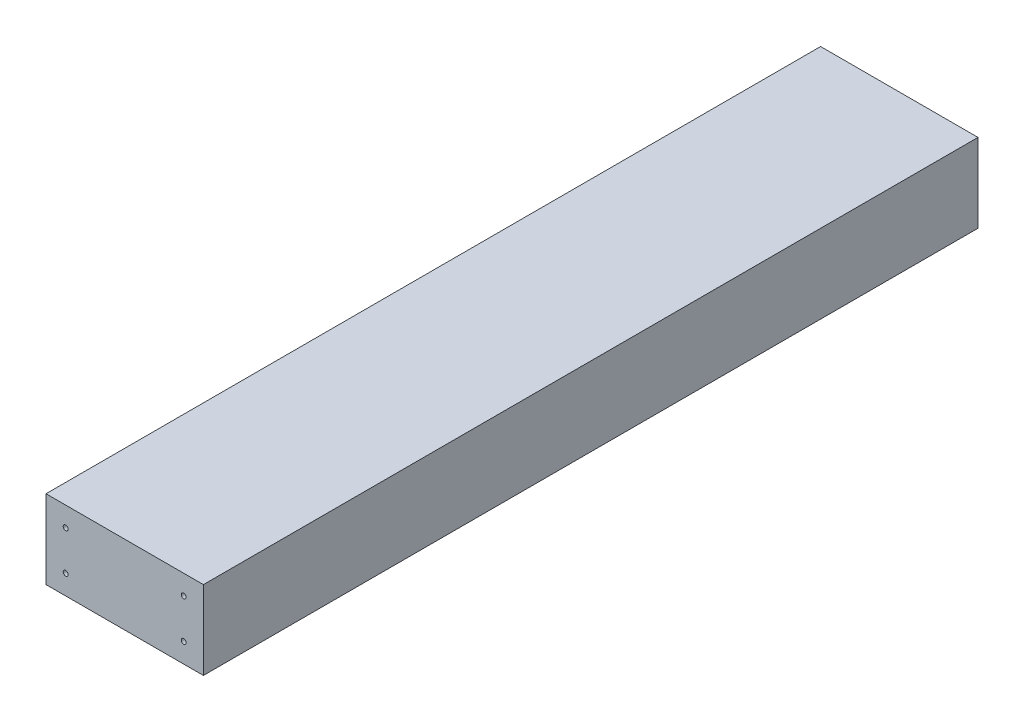
ISO-10303-21;
HEADER;
FILE_DESCRIPTION(('STEP AP214'),'2;1');
FILE_NAME('part.step','',(''),(''),'','','');
FILE_SCHEMA(('AUTOMOTIVE_DESIGN { 1 0 10303 214 1 1 1 1 }'));
ENDSEC;
DATA;
#1=APPLICATION_CONTEXT('core data for automotive mechanical design processes');
#2=APPLICATION_PROTOCOL_DEFINITION('international standard','automotive_design',2000,#1);
#3=PRODUCT_CONTEXT('',#1,'mechanical');
#4=PRODUCT('Part','Part','',(#3));
#5=PRODUCT_RELATED_PRODUCT_CATEGORY('part','',(#4));
#6=PRODUCT_DEFINITION_FORMATION('','',#4);
#7=PRODUCT_DEFINITION_CONTEXT('part definition',#1,'design');
#8=PRODUCT_DEFINITION('design','',#6,#7);
#9=PRODUCT_DEFINITION_SHAPE('','',#8);
#10=(LENGTH_UNIT() NAMED_UNIT(*) SI_UNIT(.MILLI.,.METRE.));
#11=(NAMED_UNIT(*) PLANE_ANGLE_UNIT() SI_UNIT($,.RADIAN.));
#12=(NAMED_UNIT(*) SI_UNIT($,.STERADIAN.) SOLID_ANGLE_UNIT());
#13=UNCERTAINTY_MEASURE_WITH_UNIT(LENGTH_MEASURE(1.E-05),#10,'distance_accuracy_value','');
#14=(GEOMETRIC_REPRESENTATION_CONTEXT(3) GLOBAL_UNCERTAINTY_ASSIGNED_CONTEXT((#13)) GLOBAL_UNIT_ASSIGNED_CONTEXT((#10,
#11,#12)) REPRESENTATION_CONTEXT('',''));
#15=CARTESIAN_POINT('',(0.,0.,0.));
#16=DIRECTION('',(0.,0.,1.));
#17=DIRECTION('',(1.,0.,0.));
#18=AXIS2_PLACEMENT_3D('',#15,#16,#17);
#19=CARTESIAN_POINT('',(50.8,-25.4,500.));
#20=DIRECTION('',(-1.,0.,0.));
#21=DIRECTION('',(0.,0.,1.));
#22=AXIS2_PLACEMENT_3D('',#19,#20,#21);
#23=PLANE('',#22);
#24=DIRECTION('',(0.,1.,0.));
#25=VECTOR('',#24,1.);
#26=CARTESIAN_POINT('',(50.8,-25.4,0.));
#27=LINE('',#26,#25);
#28=CARTESIAN_POINT('',(50.8,-25.4,0.));
#29=VERTEX_POINT('',#28);
#30=CARTESIAN_POINT('',(50.8,25.4,0.));
#31=VERTEX_POINT('',#30);
#32=EDGE_CURVE('E97',#29,#31,#27,.T.);
#33=ORIENTED_EDGE('',*,*,#32,.T.);
#34=DIRECTION('',(0.,0.,-1.));
#35=VECTOR('',#34,1.);
#36=CARTESIAN_POINT('',(50.8,25.4,500.));
#37=LINE('',#36,#35);
#38=CARTESIAN_POINT('',(50.8,25.4,500.));
#39=VERTEX_POINT('',#38);
#40=EDGE_CURVE('E11',#39,#31,#37,.T.);
#41=ORIENTED_EDGE('',*,*,#40,.F.);
#42=DIRECTION('',(0.,1.,0.));
#43=VECTOR('',#42,1.);
#44=CARTESIAN_POINT('',(50.8,-25.4,500.));
#45=LINE('',#44,#43);
#46=CARTESIAN_POINT('',(50.8,-25.4,500.));
#47=VERTEX_POINT('',#46);
#48=EDGE_CURVE('E85',#47,#39,#45,.T.);
#49=ORIENTED_EDGE('',*,*,#48,.F.);
#50=DIRECTION('',(0.,0.,-1.));
#51=VECTOR('',#50,1.);
#52=CARTESIAN_POINT('',(50.8,-25.4,500.));
#53=LINE('',#52,#51);
#54=EDGE_CURVE('E93',#47,#29,#53,.T.);
#55=ORIENTED_EDGE('',*,*,#54,.T.);
#56=EDGE_LOOP('',(#33,#41,#49,#55));
#57=FACE_BOUND('',#56,.T.);
#58=ADVANCED_FACE('F34',(#57),#23,.F.);
#59=CARTESIAN_POINT('',(-50.8,25.4,500.));
#60=DIRECTION('',(0.,-1.,0.));
#61=DIRECTION('',(0.,0.,-1.));
#62=AXIS2_PLACEMENT_3D('',#59,#60,#61);
#63=PLANE('',#62);
#64=DIRECTION('',(-1.,0.,0.));
#65=VECTOR('',#64,1.);
#66=CARTESIAN_POINT('',(-50.8,25.4,0.));
#67=LINE('',#66,#65);
#68=CARTESIAN_POINT('',(-50.8,25.4,0.));
#69=VERTEX_POINT('',#68);
#70=EDGE_CURVE('E89',#31,#69,#67,.T.);
#71=ORIENTED_EDGE('',*,*,#70,.T.);
#72=DIRECTION('',(0.,0.,-1.));
#73=VECTOR('',#72,1.);
#74=CARTESIAN_POINT('',(-50.8,25.4,500.));
#75=LINE('',#74,#73);
#76=CARTESIAN_POINT('',(-50.8,25.4,500.));
#77=VERTEX_POINT('',#76);
#78=EDGE_CURVE('E42',#77,#69,#75,.T.);
#79=ORIENTED_EDGE('',*,*,#78,.F.);
#80=DIRECTION('',(-1.,0.,0.));
#81=VECTOR('',#80,1.);
#82=CARTESIAN_POINT('',(-50.8,25.4,500.));
#83=LINE('',#82,#81);
#84=EDGE_CURVE('E80',#39,#77,#83,.T.);
#85=ORIENTED_EDGE('',*,*,#84,.F.);
#86=ORIENTED_EDGE('',*,*,#40,.T.);
#87=EDGE_LOOP('',(#71,#79,#85,#86));
#88=FACE_BOUND('',#87,.T.);
#89=ADVANCED_FACE('F88',(#88),#63,.F.);
#90=CARTESIAN_POINT('',(-50.8,-25.4,500.));
#91=DIRECTION('',(1.,0.,0.));
#92=DIRECTION('',(0.,0.,-1.));
#93=AXIS2_PLACEMENT_3D('',#90,#91,#92);
#94=PLANE('',#93);
#95=DIRECTION('',(0.,-1.,0.));
#96=VECTOR('',#95,1.);
#97=CARTESIAN_POINT('',(-50.8,-25.4,0.));
#98=LINE('',#97,#96);
#99=CARTESIAN_POINT('',(-50.8,-25.4,0.));
#100=VERTEX_POINT('',#99);
#101=EDGE_CURVE('E67',#69,#100,#98,.T.);
#102=ORIENTED_EDGE('',*,*,#101,.T.);
#103=DIRECTION('',(0.,0.,-1.));
#104=VECTOR('',#103,1.);
#105=CARTESIAN_POINT('',(-50.8,-25.4,500.));
#106=LINE('',#105,#104);
#107=CARTESIAN_POINT('',(-50.8,-25.4,500.));
#108=VERTEX_POINT('',#107);
#109=EDGE_CURVE('E90',#108,#100,#106,.T.);
#110=ORIENTED_EDGE('',*,*,#109,.F.);
#111=DIRECTION('',(0.,-1.,0.));
#112=VECTOR('',#111,1.);
#113=CARTESIAN_POINT('',(-50.8,-25.4,500.));
#114=LINE('',#113,#112);
#115=EDGE_CURVE('E83',#77,#108,#114,.T.);
#116=ORIENTED_EDGE('',*,*,#115,.F.);
#117=ORIENTED_EDGE('',*,*,#78,.T.);
#118=EDGE_LOOP('',(#102,#110,#116,#117));
#119=FACE_BOUND('',#118,.T.);
#120=ADVANCED_FACE('F91',(#119),#94,.F.);
#121=CARTESIAN_POINT('',(-50.8,-25.4,500.));
#122=DIRECTION('',(0.,1.,0.));
#123=DIRECTION('',(0.,0.,1.));
#124=AXIS2_PLACEMENT_3D('',#121,#122,#123);
#125=PLANE('',#124);
#126=DIRECTION('',(1.,0.,0.));
#127=VECTOR('',#126,1.);
#128=CARTESIAN_POINT('',(-50.8,-25.4,0.));
#129=LINE('',#128,#127);
#130=EDGE_CURVE('E73',#100,#29,#129,.T.);
#131=ORIENTED_EDGE('',*,*,#130,.T.);
#132=ORIENTED_EDGE('',*,*,#54,.F.);
#133=DIRECTION('',(1.,0.,0.));
#134=VECTOR('',#133,1.);
#135=CARTESIAN_POINT('',(-50.8,-25.4,500.));
#136=LINE('',#135,#134);
#137=EDGE_CURVE('E50',#108,#47,#136,.T.);
#138=ORIENTED_EDGE('',*,*,#137,.F.);
#139=ORIENTED_EDGE('',*,*,#109,.T.);
#140=EDGE_LOOP('',(#131,#132,#138,#139));
#141=FACE_BOUND('',#140,.T.);
#142=ADVANCED_FACE('F105',(#141),#125,.F.);
#143=CARTESIAN_POINT('',(0.,0.,500.));
#144=DIRECTION('',(0.,0.,-1.));
#145=DIRECTION('',(-1.,0.,0.));
#146=AXIS2_PLACEMENT_3D('',#143,#144,#145);
#147=PLANE('',#146);
#148=CARTESIAN_POINT('',(-38.1,-12.7,500.));
#149=DIRECTION('',(0.,0.,1.));
#150=DIRECTION('',(1.,0.,0.));
#151=AXIS2_PLACEMENT_3D('',#148,#149,#150);
#152=CIRCLE('',#151,1.58750000000001);
#153=CARTESIAN_POINT('',(-36.5125,-12.7,500.));
#154=VERTEX_POINT('',#153);
#155=EDGE_CURVE('E117',#154,#154,#152,.T.);
#156=ORIENTED_EDGE('',*,*,#155,.F.);
#157=EDGE_LOOP('',(#156));
#158=FACE_BOUND('',#157,.T.);
#159=CARTESIAN_POINT('',(38.1,-12.7,500.));
#160=DIRECTION('',(0.,0.,1.));
#161=DIRECTION('',(1.,0.,0.));
#162=AXIS2_PLACEMENT_3D('',#159,#160,#161);
#163=CIRCLE('',#162,1.58750000000001);
#164=CARTESIAN_POINT('',(39.6875,-12.7,500.));
#165=VERTEX_POINT('',#164);
#166=EDGE_CURVE('E124',#165,#165,#163,.T.);
#167=ORIENTED_EDGE('',*,*,#166,.F.);
#168=EDGE_LOOP('',(#167));
#169=FACE_BOUND('',#168,.T.);
#170=CARTESIAN_POINT('',(38.1,12.7,500.));
#171=DIRECTION('',(0.,0.,1.));
#172=DIRECTION('',(1.,0.,0.));
#173=AXIS2_PLACEMENT_3D('',#170,#171,#172);
#174=CIRCLE('',#173,1.58750000000001);
#175=CARTESIAN_POINT('',(39.6875,12.7,500.));
#176=VERTEX_POINT('',#175);
#177=EDGE_CURVE('E130',#176,#176,#174,.T.);
#178=ORIENTED_EDGE('',*,*,#177,.F.);
#179=EDGE_LOOP('',(#178));
#180=FACE_BOUND('',#179,.T.);
#181=CARTESIAN_POINT('',(-38.1,12.7,500.));
#182=DIRECTION('',(0.,0.,1.));
#183=DIRECTION('',(1.,0.,0.));
#184=AXIS2_PLACEMENT_3D('',#181,#182,#183);
#185=CIRCLE('',#184,1.58750000000001);
#186=CARTESIAN_POINT('',(-36.5125,12.7,500.));
#187=VERTEX_POINT('',#186);
#188=EDGE_CURVE('E111',#187,#187,#185,.T.);
#189=ORIENTED_EDGE('',*,*,#188,.F.);
#190=EDGE_LOOP('',(#189));
#191=FACE_BOUND('',#190,.T.);
#192=ORIENTED_EDGE('',*,*,#48,.T.);
#193=ORIENTED_EDGE('',*,*,#84,.T.);
#194=ORIENTED_EDGE('',*,*,#115,.T.);
#195=ORIENTED_EDGE('',*,*,#137,.T.);
#196=EDGE_LOOP('',(#192,#193,#194,#195));
#197=FACE_BOUND('',#196,.T.);
#198=ADVANCED_FACE('F81',(#158,#169,#180,#191,#197),#147,.F.);
#199=CARTESIAN_POINT('',(0.,0.,0.));
#200=DIRECTION('',(0.,0.,-1.));
#201=DIRECTION('',(-1.,0.,0.));
#202=AXIS2_PLACEMENT_3D('',#199,#200,#201);
#203=PLANE('',#202);
#204=CARTESIAN_POINT('',(-38.1,-12.7,0.));
#205=DIRECTION('',(0.,0.,1.));
#206=DIRECTION('',(1.,0.,0.));
#207=AXIS2_PLACEMENT_3D('',#204,#205,#206);
#208=CIRCLE('',#207,1.58750000000001);
#209=CARTESIAN_POINT('',(-36.5125,-12.7,0.));
#210=VERTEX_POINT('',#209);
#211=EDGE_CURVE('E141',#210,#210,#208,.T.);
#212=ORIENTED_EDGE('',*,*,#211,.T.);
#213=EDGE_LOOP('',(#212));
#214=FACE_BOUND('',#213,.T.);
#215=CARTESIAN_POINT('',(38.1,-12.7,0.));
#216=DIRECTION('',(0.,0.,1.));
#217=DIRECTION('',(1.,0.,0.));
#218=AXIS2_PLACEMENT_3D('',#215,#216,#217);
#219=CIRCLE('',#218,1.58750000000001);
#220=CARTESIAN_POINT('',(39.6875,-12.7,0.));
#221=VERTEX_POINT('',#220);
#222=EDGE_CURVE('E147',#221,#221,#219,.T.);
#223=ORIENTED_EDGE('',*,*,#222,.T.);
#224=EDGE_LOOP('',(#223));
#225=FACE_BOUND('',#224,.T.);
#226=CARTESIAN_POINT('',(38.1,12.7,0.));
#227=DIRECTION('',(0.,0.,1.));
#228=DIRECTION('',(1.,0.,0.));
#229=AXIS2_PLACEMENT_3D('',#226,#227,#228);
#230=CIRCLE('',#229,1.58750000000001);
#231=CARTESIAN_POINT('',(39.6875,12.7,0.));
#232=VERTEX_POINT('',#231);
#233=EDGE_CURVE('E153',#232,#232,#230,.T.);
#234=ORIENTED_EDGE('',*,*,#233,.T.);
#235=EDGE_LOOP('',(#234));
#236=FACE_BOUND('',#235,.T.);
#237=CARTESIAN_POINT('',(-38.1,12.7,0.));
#238=DIRECTION('',(0.,0.,1.));
#239=DIRECTION('',(1.,0.,0.));
#240=AXIS2_PLACEMENT_3D('',#237,#238,#239);
#241=CIRCLE('',#240,1.58750000000001);
#242=CARTESIAN_POINT('',(-36.5125,12.7,0.));
#243=VERTEX_POINT('',#242);
#244=EDGE_CURVE('E135',#243,#243,#241,.T.);
#245=ORIENTED_EDGE('',*,*,#244,.T.);
#246=EDGE_LOOP('',(#245));
#247=FACE_BOUND('',#246,.T.);
#248=ORIENTED_EDGE('',*,*,#32,.F.);
#249=ORIENTED_EDGE('',*,*,#130,.F.);
#250=ORIENTED_EDGE('',*,*,#101,.F.);
#251=ORIENTED_EDGE('',*,*,#70,.F.);
#252=EDGE_LOOP('',(#248,#249,#250,#251));
#253=FACE_BOUND('',#252,.T.);
#254=ADVANCED_FACE('F108',(#214,#225,#236,#247,#253),#203,.T.);
#255=CARTESIAN_POINT('',(-38.1,12.7,455.55));
#256=DIRECTION('',(0.,0.,1.));
#257=DIRECTION('',(1.,0.,0.));
#258=AXIS2_PLACEMENT_3D('',#255,#256,#257);
#259=CYLINDRICAL_SURFACE('',#258,1.58750000000001);
#260=CARTESIAN_POINT('',(-38.1,12.7,455.55));
#261=DIRECTION('',(0.,0.,1.));
#262=DIRECTION('',(1.,0.,0.));
#263=AXIS2_PLACEMENT_3D('',#260,#261,#262);
#264=CIRCLE('',#263,1.58750000000001);
#265=CARTESIAN_POINT('',(-36.5125,12.7,455.55));
#266=VERTEX_POINT('',#265);
#267=EDGE_CURVE('E100',#266,#266,#264,.T.);
#268=ORIENTED_EDGE('',*,*,#267,.F.);
#269=EDGE_LOOP('',(#268));
#270=FACE_BOUND('',#269,.T.);
#271=ORIENTED_EDGE('',*,*,#188,.T.);
#272=EDGE_LOOP('',(#271));
#273=FACE_BOUND('',#272,.T.);
#274=ADVANCED_FACE('F188',(#270,#273),#259,.F.);
#275=CARTESIAN_POINT('',(-38.1,12.7,455.55));
#276=DIRECTION('',(0.,0.,1.));
#277=DIRECTION('',(1.,0.,0.));
#278=AXIS2_PLACEMENT_3D('',#275,#276,#277);
#279=PLANE('',#278);
#280=ORIENTED_EDGE('',*,*,#267,.T.);
#281=EDGE_LOOP('',(#280));
#282=FACE_BOUND('',#281,.T.);
#283=ADVANCED_FACE('F195',(#282),#279,.T.);
#284=CARTESIAN_POINT('',(38.1,12.7,455.55));
#285=DIRECTION('',(0.,0.,1.));
#286=DIRECTION('',(1.,0.,0.));
#287=AXIS2_PLACEMENT_3D('',#284,#285,#286);
#288=CYLINDRICAL_SURFACE('',#287,1.58750000000001);
#289=CARTESIAN_POINT('',(38.1,12.7,455.55));
#290=DIRECTION('',(0.,0.,1.));
#291=DIRECTION('',(1.,0.,0.));
#292=AXIS2_PLACEMENT_3D('',#289,#290,#291);
#293=CIRCLE('',#292,1.58750000000001);
#294=CARTESIAN_POINT('',(39.6875,12.7,455.55));
#295=VERTEX_POINT('',#294);
#296=EDGE_CURVE('E114',#295,#295,#293,.T.);
#297=ORIENTED_EDGE('',*,*,#296,.F.);
#298=EDGE_LOOP('',(#297));
#299=FACE_BOUND('',#298,.T.);
#300=ORIENTED_EDGE('',*,*,#177,.T.);
#301=EDGE_LOOP('',(#300));
#302=FACE_BOUND('',#301,.T.);
#303=ADVANCED_FACE('F199',(#299,#302),#288,.F.);
#304=CARTESIAN_POINT('',(38.1,12.7,455.55));
#305=DIRECTION('',(0.,0.,1.));
#306=DIRECTION('',(1.,0.,0.));
#307=AXIS2_PLACEMENT_3D('',#304,#305,#306);
#308=PLANE('',#307);
#309=ORIENTED_EDGE('',*,*,#296,.T.);
#310=EDGE_LOOP('',(#309));
#311=FACE_BOUND('',#310,.T.);
#312=ADVANCED_FACE('F214',(#311),#308,.T.);
#313=CARTESIAN_POINT('',(38.1,-12.7,455.55));
#314=DIRECTION('',(0.,0.,1.));
#315=DIRECTION('',(1.,0.,0.));
#316=AXIS2_PLACEMENT_3D('',#313,#314,#315);
#317=CYLINDRICAL_SURFACE('',#316,1.58750000000001);
#318=CARTESIAN_POINT('',(38.1,-12.7,455.55));
#319=DIRECTION('',(0.,0.,1.));
#320=DIRECTION('',(1.,0.,0.));
#321=AXIS2_PLACEMENT_3D('',#318,#319,#320);
#322=CIRCLE('',#321,1.58750000000001);
#323=CARTESIAN_POINT('',(39.6875,-12.7,455.55));
#324=VERTEX_POINT('',#323);
#325=EDGE_CURVE('E127',#324,#324,#322,.T.);
#326=ORIENTED_EDGE('',*,*,#325,.F.);
#327=EDGE_LOOP('',(#326));
#328=FACE_BOUND('',#327,.T.);
#329=ORIENTED_EDGE('',*,*,#166,.T.);
#330=EDGE_LOOP('',(#329));
#331=FACE_BOUND('',#330,.T.);
#332=ADVANCED_FACE('F211',(#328,#331),#317,.F.);
#333=CARTESIAN_POINT('',(38.1,-12.7,455.55));
#334=DIRECTION('',(0.,0.,1.));
#335=DIRECTION('',(1.,0.,0.));
#336=AXIS2_PLACEMENT_3D('',#333,#334,#335);
#337=PLANE('',#336);
#338=ORIENTED_EDGE('',*,*,#325,.T.);
#339=EDGE_LOOP('',(#338));
#340=FACE_BOUND('',#339,.T.);
#341=ADVANCED_FACE('F205',(#340),#337,.T.);
#342=CARTESIAN_POINT('',(-38.1,-12.7,455.55));
#343=DIRECTION('',(0.,0.,1.));
#344=DIRECTION('',(1.,0.,0.));
#345=AXIS2_PLACEMENT_3D('',#342,#343,#344);
#346=CYLINDRICAL_SURFACE('',#345,1.58750000000001);
#347=CARTESIAN_POINT('',(-38.1,-12.7,455.55));
#348=DIRECTION('',(0.,0.,1.));
#349=DIRECTION('',(1.,0.,0.));
#350=AXIS2_PLACEMENT_3D('',#347,#348,#349);
#351=CIRCLE('',#350,1.58750000000001);
#352=CARTESIAN_POINT('',(-36.5125,-12.7,455.55));
#353=VERTEX_POINT('',#352);
#354=EDGE_CURVE('E120',#353,#353,#351,.T.);
#355=ORIENTED_EDGE('',*,*,#354,.F.);
#356=EDGE_LOOP('',(#355));
#357=FACE_BOUND('',#356,.T.);
#358=ORIENTED_EDGE('',*,*,#155,.T.);
#359=EDGE_LOOP('',(#358));
#360=FACE_BOUND('',#359,.T.);
#361=ADVANCED_FACE('F201',(#357,#360),#346,.F.);
#362=CARTESIAN_POINT('',(-38.1,-12.7,455.55));
#363=DIRECTION('',(0.,0.,1.));
#364=DIRECTION('',(1.,0.,0.));
#365=AXIS2_PLACEMENT_3D('',#362,#363,#364);
#366=PLANE('',#365);
#367=ORIENTED_EDGE('',*,*,#354,.T.);
#368=EDGE_LOOP('',(#367));
#369=FACE_BOUND('',#368,.T.);
#370=ADVANCED_FACE('F204',(#369),#366,.T.);
#371=CARTESIAN_POINT('',(-38.1,12.7,44.45));
#372=DIRECTION('',(0.,0.,-1.));
#373=DIRECTION('',(-1.,0.,0.));
#374=AXIS2_PLACEMENT_3D('',#371,#372,#373);
#375=CYLINDRICAL_SURFACE('',#374,1.58750000000001);
#376=CARTESIAN_POINT('',(-38.1,12.7,44.45));
#377=DIRECTION('',(0.,0.,1.));
#378=DIRECTION('',(1.,0.,0.));
#379=AXIS2_PLACEMENT_3D('',#376,#377,#378);
#380=CIRCLE('',#379,1.58750000000001);
#381=CARTESIAN_POINT('',(-36.5125,12.7,44.45));
#382=VERTEX_POINT('',#381);
#383=EDGE_CURVE('E121',#382,#382,#380,.T.);
#384=ORIENTED_EDGE('',*,*,#383,.T.);
#385=EDGE_LOOP('',(#384));
#386=FACE_BOUND('',#385,.T.);
#387=ORIENTED_EDGE('',*,*,#244,.F.);
#388=EDGE_LOOP('',(#387));
#389=FACE_BOUND('',#388,.T.);
#390=ADVANCED_FACE('F209',(#386,#389),#375,.F.);
#391=CARTESIAN_POINT('',(-38.1,12.7,44.45));
#392=DIRECTION('',(0.,0.,-1.));
#393=DIRECTION('',(1.,0.,0.));
#394=AXIS2_PLACEMENT_3D('',#391,#392,#393);
#395=PLANE('',#394);
#396=ORIENTED_EDGE('',*,*,#383,.F.);
#397=EDGE_LOOP('',(#396));
#398=FACE_BOUND('',#397,.T.);
#399=ADVANCED_FACE('F173',(#398),#395,.T.);
#400=CARTESIAN_POINT('',(38.1,12.7,44.45));
#401=DIRECTION('',(0.,0.,-1.));
#402=DIRECTION('',(-1.,0.,0.));
#403=AXIS2_PLACEMENT_3D('',#400,#401,#402);
#404=CYLINDRICAL_SURFACE('',#403,1.58750000000001);
#405=CARTESIAN_POINT('',(38.1,12.7,44.45));
#406=DIRECTION('',(0.,0.,1.));
#407=DIRECTION('',(1.,0.,0.));
#408=AXIS2_PLACEMENT_3D('',#405,#406,#407);
#409=CIRCLE('',#408,1.58750000000001);
#410=CARTESIAN_POINT('',(39.6875,12.7,44.45));
#411=VERTEX_POINT('',#410);
#412=EDGE_CURVE('E138',#411,#411,#409,.T.);
#413=ORIENTED_EDGE('',*,*,#412,.T.);
#414=EDGE_LOOP('',(#413));
#415=FACE_BOUND('',#414,.T.);
#416=ORIENTED_EDGE('',*,*,#233,.F.);
#417=EDGE_LOOP('',(#416));
#418=FACE_BOUND('',#417,.T.);
#419=ADVANCED_FACE('F159',(#415,#418),#404,.F.);
#420=CARTESIAN_POINT('',(38.1,12.7,44.45));
#421=DIRECTION('',(0.,0.,-1.));
#422=DIRECTION('',(1.,0.,0.));
#423=AXIS2_PLACEMENT_3D('',#420,#421,#422);
#424=PLANE('',#423);
#425=ORIENTED_EDGE('',*,*,#412,.F.);
#426=EDGE_LOOP('',(#425));
#427=FACE_BOUND('',#426,.T.);
#428=ADVANCED_FACE('F162',(#427),#424,.T.);
#429=CARTESIAN_POINT('',(38.1,-12.7,44.45));
#430=DIRECTION('',(0.,0.,-1.));
#431=DIRECTION('',(-1.,0.,0.));
#432=AXIS2_PLACEMENT_3D('',#429,#430,#431);
#433=CYLINDRICAL_SURFACE('',#432,1.58750000000001);
#434=CARTESIAN_POINT('',(38.1,-12.7,44.45));
#435=DIRECTION('',(0.,0.,1.));
#436=DIRECTION('',(1.,0.,0.));
#437=AXIS2_PLACEMENT_3D('',#434,#435,#436);
#438=CIRCLE('',#437,1.58750000000001);
#439=CARTESIAN_POINT('',(39.6875,-12.7,44.45));
#440=VERTEX_POINT('',#439);
#441=EDGE_CURVE('E150',#440,#440,#438,.T.);
#442=ORIENTED_EDGE('',*,*,#441,.T.);
#443=EDGE_LOOP('',(#442));
#444=FACE_BOUND('',#443,.T.);
#445=ORIENTED_EDGE('',*,*,#222,.F.);
#446=EDGE_LOOP('',(#445));
#447=FACE_BOUND('',#446,.T.);
#448=ADVANCED_FACE('F164',(#444,#447),#433,.F.);
#449=CARTESIAN_POINT('',(38.1,-12.7,44.45));
#450=DIRECTION('',(0.,0.,-1.));
#451=DIRECTION('',(1.,0.,0.));
#452=AXIS2_PLACEMENT_3D('',#449,#450,#451);
#453=PLANE('',#452);
#454=ORIENTED_EDGE('',*,*,#441,.F.);
#455=EDGE_LOOP('',(#454));
#456=FACE_BOUND('',#455,.T.);
#457=ADVANCED_FACE('F170',(#456),#453,.T.);
#458=CARTESIAN_POINT('',(-38.1,-12.7,44.45));
#459=DIRECTION('',(0.,0.,-1.));
#460=DIRECTION('',(-1.,0.,0.));
#461=AXIS2_PLACEMENT_3D('',#458,#459,#460);
#462=CYLINDRICAL_SURFACE('',#461,1.58750000000001);
#463=CARTESIAN_POINT('',(-38.1,-12.7,44.45));
#464=DIRECTION('',(0.,0.,1.));
#465=DIRECTION('',(1.,0.,0.));
#466=AXIS2_PLACEMENT_3D('',#463,#464,#465);
#467=CIRCLE('',#466,1.58750000000001);
#468=CARTESIAN_POINT('',(-36.5125,-12.7,44.45));
#469=VERTEX_POINT('',#468);
#470=EDGE_CURVE('E144',#469,#469,#467,.T.);
#471=ORIENTED_EDGE('',*,*,#470,.T.);
#472=EDGE_LOOP('',(#471));
#473=FACE_BOUND('',#472,.T.);
#474=ORIENTED_EDGE('',*,*,#211,.F.);
#475=EDGE_LOOP('',(#474));
#476=FACE_BOUND('',#475,.T.);
#477=ADVANCED_FACE('F231',(#473,#476),#462,.F.);
#478=CARTESIAN_POINT('',(-38.1,-12.7,44.45));
#479=DIRECTION('',(0.,0.,-1.));
#480=DIRECTION('',(1.,0.,0.));
#481=AXIS2_PLACEMENT_3D('',#478,#479,#480);
#482=PLANE('',#481);
#483=ORIENTED_EDGE('',*,*,#470,.F.);
#484=EDGE_LOOP('',(#483));
#485=FACE_BOUND('',#484,.T.);
#486=ADVANCED_FACE('F234',(#485),#482,.T.);
#487=CLOSED_SHELL('',(#58,#89,#120,#142,#198,#254,#274,#283,#303,#312,#332,#341,#361,#370,#390,
#399,#419,#428,#448,#457,#477,#486));
#488=MANIFOLD_SOLID_BREP('B2',#487);
#489=ADVANCED_BREP_SHAPE_REPRESENTATION('',(#18,#488),#14);
#490=SHAPE_DEFINITION_REPRESENTATION(#9,#489);
ENDSEC;
END-ISO-10303-21;
